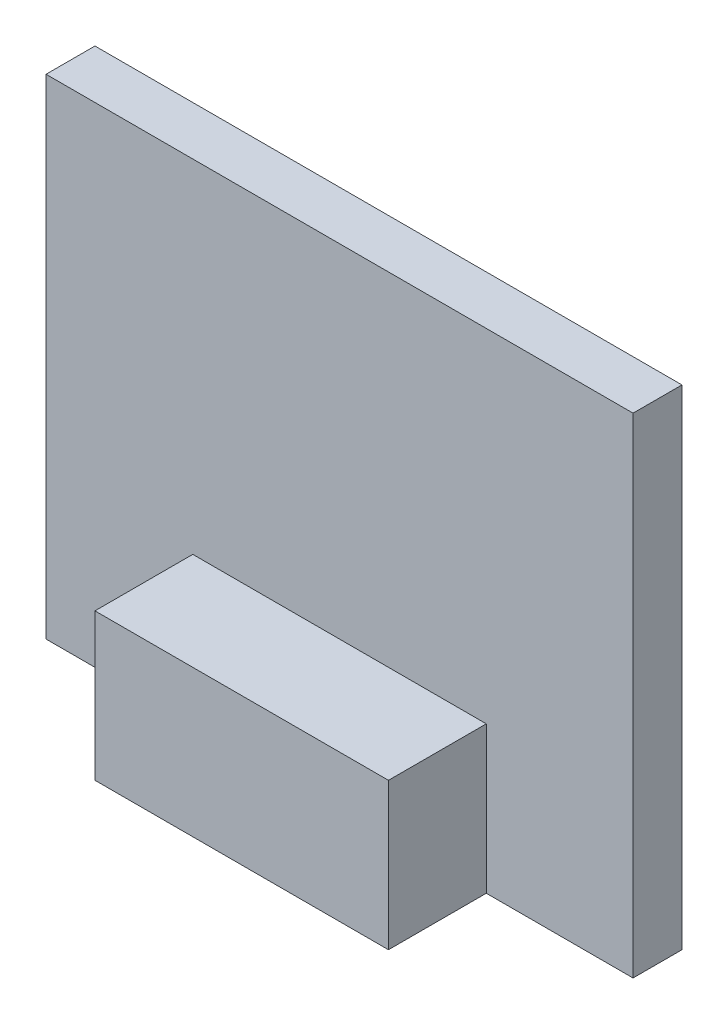
ISO-10303-21;
HEADER;
FILE_DESCRIPTION(('STEP AP214'),'2;1');
FILE_NAME('part.step','',(''),(''),'','','');
FILE_SCHEMA(('AUTOMOTIVE_DESIGN { 1 0 10303 214 1 1 1 1 }'));
ENDSEC;
DATA;
#1=APPLICATION_CONTEXT('core data for automotive mechanical design processes');
#2=APPLICATION_PROTOCOL_DEFINITION('international standard','automotive_design',2000,#1);
#3=PRODUCT_CONTEXT('',#1,'mechanical');
#4=PRODUCT('Part','Part','',(#3));
#5=PRODUCT_RELATED_PRODUCT_CATEGORY('part','',(#4));
#6=PRODUCT_DEFINITION_FORMATION('','',#4);
#7=PRODUCT_DEFINITION_CONTEXT('part definition',#1,'design');
#8=PRODUCT_DEFINITION('design','',#6,#7);
#9=PRODUCT_DEFINITION_SHAPE('','',#8);
#10=(LENGTH_UNIT() NAMED_UNIT(*) SI_UNIT(.MILLI.,.METRE.));
#11=(NAMED_UNIT(*) PLANE_ANGLE_UNIT() SI_UNIT($,.RADIAN.));
#12=(NAMED_UNIT(*) SI_UNIT($,.STERADIAN.) SOLID_ANGLE_UNIT());
#13=UNCERTAINTY_MEASURE_WITH_UNIT(LENGTH_MEASURE(1.E-05),#10,'distance_accuracy_value','');
#14=(GEOMETRIC_REPRESENTATION_CONTEXT(3) GLOBAL_UNCERTAINTY_ASSIGNED_CONTEXT((#13)) GLOBAL_UNIT_ASSIGNED_CONTEXT((#10,
#11,#12)) REPRESENTATION_CONTEXT('',''));
#15=CARTESIAN_POINT('',(0.,0.,0.));
#16=DIRECTION('',(0.,0.,1.));
#17=DIRECTION('',(1.,0.,0.));
#18=AXIS2_PLACEMENT_3D('',#15,#16,#17);
#19=CARTESIAN_POINT('',(-38.1,31.75,6.35));
#20=DIRECTION('',(1.,0.,0.));
#21=DIRECTION('',(0.,1.,0.));
#22=AXIS2_PLACEMENT_3D('',#19,#20,#21);
#23=PLANE('',#22);
#24=DIRECTION('',(0.,-1.,0.));
#25=VECTOR('',#24,1.);
#26=CARTESIAN_POINT('',(-38.1,31.75,0.));
#27=LINE('',#26,#25);
#28=CARTESIAN_POINT('',(-38.1,31.75,0.));
#29=VERTEX_POINT('',#28);
#30=CARTESIAN_POINT('',(-38.1,-31.75,0.));
#31=VERTEX_POINT('',#30);
#32=EDGE_CURVE('E120',#29,#31,#27,.T.);
#33=ORIENTED_EDGE('',*,*,#32,.T.);
#34=DIRECTION('',(0.,0.,-1.));
#35=VECTOR('',#34,1.);
#36=CARTESIAN_POINT('',(-38.1,-31.75,6.35));
#37=LINE('',#36,#35);
#38=CARTESIAN_POINT('',(-38.1,-31.75,6.35));
#39=VERTEX_POINT('',#38);
#40=EDGE_CURVE('E11',#39,#31,#37,.T.);
#41=ORIENTED_EDGE('',*,*,#40,.F.);
#42=DIRECTION('',(0.,-1.,0.));
#43=VECTOR('',#42,1.);
#44=CARTESIAN_POINT('',(-38.1,31.75,6.35));
#45=LINE('',#44,#43);
#46=CARTESIAN_POINT('',(-38.1,31.75,6.35));
#47=VERTEX_POINT('',#46);
#48=EDGE_CURVE('E138',#47,#39,#45,.T.);
#49=ORIENTED_EDGE('',*,*,#48,.F.);
#50=DIRECTION('',(0.,0.,-1.));
#51=VECTOR('',#50,1.);
#52=CARTESIAN_POINT('',(-38.1,31.75,6.35));
#53=LINE('',#52,#51);
#54=EDGE_CURVE('E147',#47,#29,#53,.T.);
#55=ORIENTED_EDGE('',*,*,#54,.T.);
#56=EDGE_LOOP('',(#33,#41,#49,#55));
#57=FACE_BOUND('',#56,.T.);
#58=ADVANCED_FACE('F33',(#57),#23,.F.);
#59=CARTESIAN_POINT('',(-38.1,-31.75,6.35));
#60=DIRECTION('',(0.,1.,0.));
#61=DIRECTION('',(0.,0.,1.));
#62=AXIS2_PLACEMENT_3D('',#59,#60,#61);
#63=PLANE('',#62);
#64=DIRECTION('',(1.,0.,0.));
#65=VECTOR('',#64,1.);
#66=CARTESIAN_POINT('',(-38.1,-31.75,0.));
#67=LINE('',#66,#65);
#68=CARTESIAN_POINT('',(38.1,-31.75,0.));
#69=VERTEX_POINT('',#68);
#70=EDGE_CURVE('E123',#31,#69,#67,.T.);
#71=ORIENTED_EDGE('',*,*,#70,.T.);
#72=DIRECTION('',(0.,0.,-1.));
#73=VECTOR('',#72,1.);
#74=CARTESIAN_POINT('',(38.1,-31.75,6.35));
#75=LINE('',#74,#73);
#76=CARTESIAN_POINT('',(38.1,-31.75,6.35));
#77=VERTEX_POINT('',#76);
#78=EDGE_CURVE('E42',#77,#69,#75,.T.);
#79=ORIENTED_EDGE('',*,*,#78,.F.);
#80=DIRECTION('',(1.,0.,0.));
#81=VECTOR('',#80,1.);
#82=CARTESIAN_POINT('',(-38.1,-31.75,6.35));
#83=LINE('',#82,#81);
#84=CARTESIAN_POINT('',(19.05,-31.75,6.35));
#85=VERTEX_POINT('',#84);
#86=EDGE_CURVE('E134',#85,#77,#83,.T.);
#87=ORIENTED_EDGE('',*,*,#86,.F.);
#88=DIRECTION('',(0.,0.,-1.));
#89=VECTOR('',#88,1.);
#90=CARTESIAN_POINT('',(19.05,-31.75,19.05));
#91=LINE('',#90,#89);
#92=CARTESIAN_POINT('',(19.05,-31.75,19.05));
#93=VERTEX_POINT('',#92);
#94=EDGE_CURVE('E104',#93,#85,#91,.T.);
#95=ORIENTED_EDGE('',*,*,#94,.F.);
#96=DIRECTION('',(1.,0.,0.));
#97=VECTOR('',#96,1.);
#98=CARTESIAN_POINT('',(-19.05,-31.75,19.05));
#99=LINE('',#98,#97);
#100=CARTESIAN_POINT('',(-19.05,-31.75,19.05));
#101=VERTEX_POINT('',#100);
#102=EDGE_CURVE('E98',#101,#93,#99,.T.);
#103=ORIENTED_EDGE('',*,*,#102,.F.);
#104=DIRECTION('',(0.,0.,-1.));
#105=VECTOR('',#104,1.);
#106=CARTESIAN_POINT('',(-19.05,-31.75,19.05));
#107=LINE('',#106,#105);
#108=CARTESIAN_POINT('',(-19.05,-31.75,6.35));
#109=VERTEX_POINT('',#108);
#110=EDGE_CURVE('E102',#101,#109,#107,.T.);
#111=ORIENTED_EDGE('',*,*,#110,.T.);
#112=EDGE_CURVE('E137',#39,#109,#83,.T.);
#113=ORIENTED_EDGE('',*,*,#112,.F.);
#114=ORIENTED_EDGE('',*,*,#40,.T.);
#115=EDGE_LOOP('',(#71,#79,#87,#95,#103,#111,#113,#114));
#116=FACE_BOUND('',#115,.T.);
#117=ADVANCED_FACE('F100',(#116),#63,.F.);
#118=CARTESIAN_POINT('',(38.1,31.75,6.35));
#119=DIRECTION('',(-1.,0.,0.));
#120=DIRECTION('',(0.,-1.,0.));
#121=AXIS2_PLACEMENT_3D('',#118,#119,#120);
#122=PLANE('',#121);
#123=DIRECTION('',(0.,1.,0.));
#124=VECTOR('',#123,1.);
#125=CARTESIAN_POINT('',(38.1,31.75,0.));
#126=LINE('',#125,#124);
#127=CARTESIAN_POINT('',(38.1,31.75,0.));
#128=VERTEX_POINT('',#127);
#129=EDGE_CURVE('E150',#69,#128,#126,.T.);
#130=ORIENTED_EDGE('',*,*,#129,.T.);
#131=DIRECTION('',(0.,0.,-1.));
#132=VECTOR('',#131,1.);
#133=CARTESIAN_POINT('',(38.1,31.75,6.35));
#134=LINE('',#133,#132);
#135=CARTESIAN_POINT('',(38.1,31.75,6.35));
#136=VERTEX_POINT('',#135);
#137=EDGE_CURVE('E156',#136,#128,#134,.T.);
#138=ORIENTED_EDGE('',*,*,#137,.F.);
#139=DIRECTION('',(0.,1.,0.));
#140=VECTOR('',#139,1.);
#141=CARTESIAN_POINT('',(38.1,31.75,6.35));
#142=LINE('',#141,#140);
#143=EDGE_CURVE('E143',#77,#136,#142,.T.);
#144=ORIENTED_EDGE('',*,*,#143,.F.);
#145=ORIENTED_EDGE('',*,*,#78,.T.);
#146=EDGE_LOOP('',(#130,#138,#144,#145));
#147=FACE_BOUND('',#146,.T.);
#148=ADVANCED_FACE('F164',(#147),#122,.F.);
#149=CARTESIAN_POINT('',(-38.1,31.75,6.35));
#150=DIRECTION('',(0.,-1.,0.));
#151=DIRECTION('',(0.,0.,-1.));
#152=AXIS2_PLACEMENT_3D('',#149,#150,#151);
#153=PLANE('',#152);
#154=DIRECTION('',(-1.,0.,0.));
#155=VECTOR('',#154,1.);
#156=CARTESIAN_POINT('',(-38.1,31.75,0.));
#157=LINE('',#156,#155);
#158=EDGE_CURVE('E152',#128,#29,#157,.T.);
#159=ORIENTED_EDGE('',*,*,#158,.T.);
#160=ORIENTED_EDGE('',*,*,#54,.F.);
#161=DIRECTION('',(-1.,0.,0.));
#162=VECTOR('',#161,1.);
#163=CARTESIAN_POINT('',(-38.1,31.75,6.35));
#164=LINE('',#163,#162);
#165=EDGE_CURVE('E146',#136,#47,#164,.T.);
#166=ORIENTED_EDGE('',*,*,#165,.F.);
#167=ORIENTED_EDGE('',*,*,#137,.T.);
#168=EDGE_LOOP('',(#159,#160,#166,#167));
#169=FACE_BOUND('',#168,.T.);
#170=ADVANCED_FACE('F172',(#169),#153,.F.);
#171=CARTESIAN_POINT('',(0.,0.,6.35));
#172=DIRECTION('',(0.,0.,1.));
#173=DIRECTION('',(1.,0.,0.));
#174=AXIS2_PLACEMENT_3D('',#171,#172,#173);
#175=PLANE('',#174);
#176=DIRECTION('',(0.,-1.,0.));
#177=VECTOR('',#176,1.);
#178=CARTESIAN_POINT('',(-19.05,-12.7,6.35));
#179=LINE('',#178,#177);
#180=CARTESIAN_POINT('',(-19.05,-12.7,6.35));
#181=VERTEX_POINT('',#180);
#182=EDGE_CURVE('E36',#181,#109,#179,.T.);
#183=ORIENTED_EDGE('',*,*,#182,.F.);
#184=DIRECTION('',(-1.,0.,0.));
#185=VECTOR('',#184,1.);
#186=CARTESIAN_POINT('',(-19.05,-12.7,6.35));
#187=LINE('',#186,#185);
#188=CARTESIAN_POINT('',(19.05,-12.7,6.35));
#189=VERTEX_POINT('',#188);
#190=EDGE_CURVE('E117',#189,#181,#187,.T.);
#191=ORIENTED_EDGE('',*,*,#190,.F.);
#192=DIRECTION('',(0.,1.,0.));
#193=VECTOR('',#192,1.);
#194=CARTESIAN_POINT('',(19.05,-12.7,6.35));
#195=LINE('',#194,#193);
#196=EDGE_CURVE('E55',#85,#189,#195,.T.);
#197=ORIENTED_EDGE('',*,*,#196,.F.);
#198=ORIENTED_EDGE('',*,*,#86,.T.);
#199=ORIENTED_EDGE('',*,*,#143,.T.);
#200=ORIENTED_EDGE('',*,*,#165,.T.);
#201=ORIENTED_EDGE('',*,*,#48,.T.);
#202=ORIENTED_EDGE('',*,*,#112,.T.);
#203=EDGE_LOOP('',(#183,#191,#197,#198,#199,#200,#201,#202));
#204=FACE_BOUND('',#203,.T.);
#205=ADVANCED_FACE('F178',(#204),#175,.T.);
#206=CARTESIAN_POINT('',(0.,0.,0.));
#207=DIRECTION('',(0.,0.,1.));
#208=DIRECTION('',(1.,0.,0.));
#209=AXIS2_PLACEMENT_3D('',#206,#207,#208);
#210=PLANE('',#209);
#211=ORIENTED_EDGE('',*,*,#32,.F.);
#212=ORIENTED_EDGE('',*,*,#158,.F.);
#213=ORIENTED_EDGE('',*,*,#129,.F.);
#214=ORIENTED_EDGE('',*,*,#70,.F.);
#215=EDGE_LOOP('',(#211,#212,#213,#214));
#216=FACE_BOUND('',#215,.T.);
#217=ADVANCED_FACE('F169',(#216),#210,.F.);
#218=CARTESIAN_POINT('',(-19.05,-12.7,19.05));
#219=DIRECTION('',(1.,0.,0.));
#220=DIRECTION('',(0.,1.,0.));
#221=AXIS2_PLACEMENT_3D('',#218,#219,#220);
#222=PLANE('',#221);
#223=ORIENTED_EDGE('',*,*,#182,.T.);
#224=ORIENTED_EDGE('',*,*,#110,.F.);
#225=DIRECTION('',(0.,-1.,0.));
#226=VECTOR('',#225,1.);
#227=CARTESIAN_POINT('',(-19.05,-12.7,19.05));
#228=LINE('',#227,#226);
#229=CARTESIAN_POINT('',(-19.05,-12.7,19.05));
#230=VERTEX_POINT('',#229);
#231=EDGE_CURVE('E108',#230,#101,#228,.T.);
#232=ORIENTED_EDGE('',*,*,#231,.F.);
#233=DIRECTION('',(0.,0.,-1.));
#234=VECTOR('',#233,1.);
#235=CARTESIAN_POINT('',(-19.05,-12.7,19.05));
#236=LINE('',#235,#234);
#237=EDGE_CURVE('E184',#230,#181,#236,.T.);
#238=ORIENTED_EDGE('',*,*,#237,.T.);
#239=EDGE_LOOP('',(#223,#224,#232,#238));
#240=FACE_BOUND('',#239,.T.);
#241=ADVANCED_FACE('F119',(#240),#222,.F.);
#242=CARTESIAN_POINT('',(19.05,-12.7,19.05));
#243=DIRECTION('',(-1.,0.,0.));
#244=DIRECTION('',(0.,-1.,0.));
#245=AXIS2_PLACEMENT_3D('',#242,#243,#244);
#246=PLANE('',#245);
#247=ORIENTED_EDGE('',*,*,#196,.T.);
#248=DIRECTION('',(0.,0.,-1.));
#249=VECTOR('',#248,1.);
#250=CARTESIAN_POINT('',(19.05,-12.7,19.05));
#251=LINE('',#250,#249);
#252=CARTESIAN_POINT('',(19.05,-12.7,19.05));
#253=VERTEX_POINT('',#252);
#254=EDGE_CURVE('E125',#253,#189,#251,.T.);
#255=ORIENTED_EDGE('',*,*,#254,.F.);
#256=DIRECTION('',(0.,1.,0.));
#257=VECTOR('',#256,1.);
#258=CARTESIAN_POINT('',(19.05,-12.7,19.05));
#259=LINE('',#258,#257);
#260=EDGE_CURVE('E107',#93,#253,#259,.T.);
#261=ORIENTED_EDGE('',*,*,#260,.F.);
#262=ORIENTED_EDGE('',*,*,#94,.T.);
#263=EDGE_LOOP('',(#247,#255,#261,#262));
#264=FACE_BOUND('',#263,.T.);
#265=ADVANCED_FACE('F180',(#264),#246,.F.);
#266=CARTESIAN_POINT('',(-19.05,-12.7,19.05));
#267=DIRECTION('',(0.,-1.,0.));
#268=DIRECTION('',(0.,0.,-1.));
#269=AXIS2_PLACEMENT_3D('',#266,#267,#268);
#270=PLANE('',#269);
#271=ORIENTED_EDGE('',*,*,#190,.T.);
#272=ORIENTED_EDGE('',*,*,#237,.F.);
#273=DIRECTION('',(-1.,0.,0.));
#274=VECTOR('',#273,1.);
#275=CARTESIAN_POINT('',(-19.05,-12.7,19.05));
#276=LINE('',#275,#274);
#277=EDGE_CURVE('E113',#253,#230,#276,.T.);
#278=ORIENTED_EDGE('',*,*,#277,.F.);
#279=ORIENTED_EDGE('',*,*,#254,.T.);
#280=EDGE_LOOP('',(#271,#272,#278,#279));
#281=FACE_BOUND('',#280,.T.);
#282=ADVANCED_FACE('F190',(#281),#270,.F.);
#283=CARTESIAN_POINT('',(0.,0.,19.05));
#284=DIRECTION('',(0.,0.,1.));
#285=DIRECTION('',(1.,0.,0.));
#286=AXIS2_PLACEMENT_3D('',#283,#284,#285);
#287=PLANE('',#286);
#288=ORIENTED_EDGE('',*,*,#231,.T.);
#289=ORIENTED_EDGE('',*,*,#102,.T.);
#290=ORIENTED_EDGE('',*,*,#260,.T.);
#291=ORIENTED_EDGE('',*,*,#277,.T.);
#292=EDGE_LOOP('',(#288,#289,#290,#291));
#293=FACE_BOUND('',#292,.T.);
#294=ADVANCED_FACE('F111',(#293),#287,.T.);
#295=CLOSED_SHELL('',(#58,#117,#148,#170,#205,#217,#241,#265,#282,#294));
#296=MANIFOLD_SOLID_BREP('B2',#295);
#297=ADVANCED_BREP_SHAPE_REPRESENTATION('',(#18,#296),#14);
#298=SHAPE_DEFINITION_REPRESENTATION(#9,#297);
ENDSEC;
END-ISO-10303-21;
